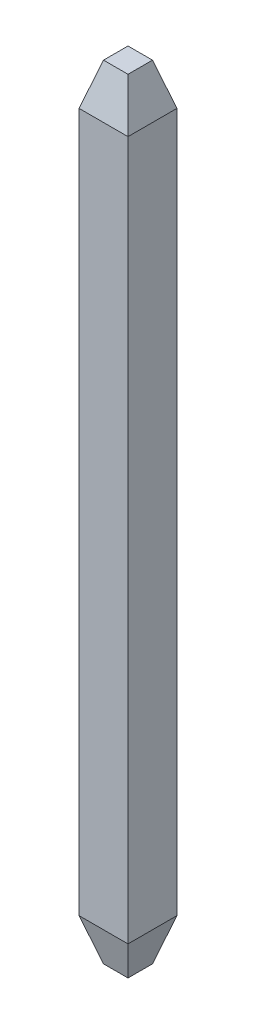
ISO-10303-21;
HEADER;
FILE_DESCRIPTION(('STEP AP214'),'2;1');
FILE_NAME('part.step','',(''),(''),'','','');
FILE_SCHEMA(('AUTOMOTIVE_DESIGN { 1 0 10303 214 1 1 1 1 }'));
ENDSEC;
DATA;
#1=APPLICATION_CONTEXT('core data for automotive mechanical design processes');
#2=APPLICATION_PROTOCOL_DEFINITION('international standard','automotive_design',2000,#1);
#3=PRODUCT_CONTEXT('',#1,'mechanical');
#4=PRODUCT('Part','Part','',(#3));
#5=PRODUCT_RELATED_PRODUCT_CATEGORY('part','',(#4));
#6=PRODUCT_DEFINITION_FORMATION('','',#4);
#7=PRODUCT_DEFINITION_CONTEXT('part definition',#1,'design');
#8=PRODUCT_DEFINITION('design','',#6,#7);
#9=PRODUCT_DEFINITION_SHAPE('','',#8);
#10=(LENGTH_UNIT() NAMED_UNIT(*) SI_UNIT(.MILLI.,.METRE.));
#11=(NAMED_UNIT(*) PLANE_ANGLE_UNIT() SI_UNIT($,.RADIAN.));
#12=(NAMED_UNIT(*) SI_UNIT($,.STERADIAN.) SOLID_ANGLE_UNIT());
#13=UNCERTAINTY_MEASURE_WITH_UNIT(LENGTH_MEASURE(1.E-05),#10,'distance_accuracy_value','');
#14=(GEOMETRIC_REPRESENTATION_CONTEXT(3) GLOBAL_UNCERTAINTY_ASSIGNED_CONTEXT((#13)) GLOBAL_UNIT_ASSIGNED_CONTEXT((#10,
#11,#12)) REPRESENTATION_CONTEXT('',''));
#15=CARTESIAN_POINT('',(0.,0.,0.));
#16=DIRECTION('',(0.,0.,1.));
#17=DIRECTION('',(1.,0.,0.));
#18=AXIS2_PLACEMENT_3D('',#15,#16,#17);
#19=CARTESIAN_POINT('',(-13.809999999987,-10.1039999999832,-17.2999999999763));
#20=DIRECTION('',(0.,-0.281214622974643,-0.959644900900968));
#21=DIRECTION('',(0.,-0.959644900900968,0.281214622974643));
#22=AXIS2_PLACEMENT_3D('',#19,#20,#21);
#23=PLANE('',#22);
#24=DIRECTION('',(1.,0.,0.));
#25=VECTOR('',#24,1.);
#26=CARTESIAN_POINT('',(-14.129999999987,-10.1039999999832,-17.2999999999763));
#27=LINE('',#26,#25);
#28=CARTESIAN_POINT('',(-14.129999999987,-10.1039999999832,-17.2999999999763));
#29=VERTEX_POINT('',#28);
#30=CARTESIAN_POINT('',(-13.489999999987,-10.1039999999832,-17.2999999999763));
#31=VERTEX_POINT('',#30);
#32=EDGE_CURVE('E11',#29,#31,#27,.T.);
#33=ORIENTED_EDGE('',*,*,#32,.T.);
#34=DIRECTION('',(-0.270714017147724,-0.923811583516618,0.270714017147727));
#35=VECTOR('',#34,1.);
#36=CARTESIAN_POINT('',(-13.489999999987,-10.1039999999832,-17.2999999999763));
#37=LINE('',#36,#35);
#38=CARTESIAN_POINT('',(-13.649999999987,-10.6499999999832,-17.1399999999763));
#39=VERTEX_POINT('',#38);
#40=EDGE_CURVE('E27',#31,#39,#37,.T.);
#41=ORIENTED_EDGE('',*,*,#40,.T.);
#42=DIRECTION('',(1.,0.,0.));
#43=VECTOR('',#42,1.);
#44=CARTESIAN_POINT('',(-13.969999999987,-10.6499999999832,-17.1399999999763));
#45=LINE('',#44,#43);
#46=CARTESIAN_POINT('',(-13.969999999987,-10.6499999999832,-17.1399999999763));
#47=VERTEX_POINT('',#46);
#48=EDGE_CURVE('E143',#47,#39,#45,.T.);
#49=ORIENTED_EDGE('',*,*,#48,.F.);
#50=DIRECTION('',(0.270714017147727,-0.923811583516618,0.270714017147727));
#51=VECTOR('',#50,1.);
#52=CARTESIAN_POINT('',(-14.129999999987,-10.1039999999832,-17.2999999999763));
#53=LINE('',#52,#51);
#54=EDGE_CURVE('E148',#29,#47,#53,.T.);
#55=ORIENTED_EDGE('',*,*,#54,.F.);
#56=EDGE_LOOP('',(#33,#41,#49,#55));
#57=FACE_BOUND('',#56,.T.);
#58=ADVANCED_FACE('F17',(#57),#23,.T.);
#59=CARTESIAN_POINT('',(-13.488999999987,-5.53443505344795,-17.2999999999763));
#60=DIRECTION('',(0.,0.,-1.));
#61=DIRECTION('',(0.,-1.,0.));
#62=AXIS2_PLACEMENT_3D('',#59,#60,#61);
#63=PLANE('',#62);
#64=DIRECTION('',(0.,1.,0.));
#65=VECTOR('',#64,1.);
#66=CARTESIAN_POINT('',(-13.489999999987,-10.1039999999832,-17.2999999999763));
#67=LINE('',#66,#65);
#68=CARTESIAN_POINT('',(-13.489999999987,-0.965870106912691,-17.2999999999763));
#69=VERTEX_POINT('',#68);
#70=EDGE_CURVE('E41',#31,#69,#67,.T.);
#71=ORIENTED_EDGE('',*,*,#70,.F.);
#72=ORIENTED_EDGE('',*,*,#32,.F.);
#73=DIRECTION('',(0.,1.,0.));
#74=VECTOR('',#73,1.);
#75=CARTESIAN_POINT('',(-14.129999999987,-10.1039999999832,-17.2999999999763));
#76=LINE('',#75,#74);
#77=CARTESIAN_POINT('',(-14.129999999987,-0.965870106912691,-17.2999999999763));
#78=VERTEX_POINT('',#77);
#79=EDGE_CURVE('E156',#29,#78,#76,.T.);
#80=ORIENTED_EDGE('',*,*,#79,.T.);
#81=DIRECTION('',(1.,0.,0.));
#82=VECTOR('',#81,1.);
#83=CARTESIAN_POINT('',(-14.129999999987,-0.965870106912693,-17.2999999999763));
#84=LINE('',#83,#82);
#85=EDGE_CURVE('E103',#78,#69,#84,.T.);
#86=ORIENTED_EDGE('',*,*,#85,.T.);
#87=EDGE_LOOP('',(#71,#72,#80,#86));
#88=FACE_BOUND('',#87,.T.);
#89=ADVANCED_FACE('F213',(#88),#63,.T.);
#90=CARTESIAN_POINT('',(-13.489999999987,-11.0738701069127,-16.9799999999763));
#91=DIRECTION('',(1.,0.,0.));
#92=DIRECTION('',(0.,1.,0.));
#93=AXIS2_PLACEMENT_3D('',#90,#91,#92);
#94=PLANE('',#93);
#95=DIRECTION('',(0.,1.,0.));
#96=VECTOR('',#95,1.);
#97=CARTESIAN_POINT('',(-13.489999999987,-10.1039999999832,-16.6599999999763));
#98=LINE('',#97,#96);
#99=CARTESIAN_POINT('',(-13.489999999987,-10.1039999999832,-16.6599999999763));
#100=VERTEX_POINT('',#99);
#101=CARTESIAN_POINT('',(-13.489999999987,-0.965870106912691,-16.6599999999763));
#102=VERTEX_POINT('',#101);
#103=EDGE_CURVE('E173',#100,#102,#98,.T.);
#104=ORIENTED_EDGE('',*,*,#103,.F.);
#105=DIRECTION('',(0.,0.,1.));
#106=VECTOR('',#105,1.);
#107=CARTESIAN_POINT('',(-13.489999999987,-10.1039999999832,-17.2999999999763));
#108=LINE('',#107,#106);
#109=EDGE_CURVE('E164',#31,#100,#108,.T.);
#110=ORIENTED_EDGE('',*,*,#109,.F.);
#111=ORIENTED_EDGE('',*,*,#70,.T.);
#112=DIRECTION('',(0.,0.,1.));
#113=VECTOR('',#112,1.);
#114=CARTESIAN_POINT('',(-13.489999999987,-0.965870106912693,-17.2999999999763));
#115=LINE('',#114,#113);
#116=EDGE_CURVE('E177',#69,#102,#115,.T.);
#117=ORIENTED_EDGE('',*,*,#116,.T.);
#118=EDGE_LOOP('',(#104,#110,#111,#117));
#119=FACE_BOUND('',#118,.T.);
#120=ADVANCED_FACE('F219',(#119),#94,.T.);
#121=CARTESIAN_POINT('',(-14.130999999987,-5.53543505344795,-16.6599999999763));
#122=DIRECTION('',(0.,0.,1.));
#123=DIRECTION('',(1.,0.,0.));
#124=AXIS2_PLACEMENT_3D('',#121,#122,#123);
#125=PLANE('',#124);
#126=DIRECTION('',(0.,1.,0.));
#127=VECTOR('',#126,1.);
#128=CARTESIAN_POINT('',(-14.129999999987,-10.1039999999832,-16.6599999999763));
#129=LINE('',#128,#127);
#130=CARTESIAN_POINT('',(-14.129999999987,-10.1039999999832,-16.6599999999763));
#131=VERTEX_POINT('',#130);
#132=CARTESIAN_POINT('',(-14.129999999987,-0.965870106912691,-16.6599999999763));
#133=VERTEX_POINT('',#132);
#134=EDGE_CURVE('E125',#131,#133,#129,.T.);
#135=ORIENTED_EDGE('',*,*,#134,.F.);
#136=DIRECTION('',(-1.,0.,0.));
#137=VECTOR('',#136,1.);
#138=CARTESIAN_POINT('',(-13.489999999987,-10.1039999999832,-16.6599999999763));
#139=LINE('',#138,#137);
#140=EDGE_CURVE('E119',#100,#131,#139,.T.);
#141=ORIENTED_EDGE('',*,*,#140,.F.);
#142=ORIENTED_EDGE('',*,*,#103,.T.);
#143=DIRECTION('',(-1.,0.,0.));
#144=VECTOR('',#143,1.);
#145=CARTESIAN_POINT('',(-13.489999999987,-0.965870106912693,-16.6599999999763));
#146=LINE('',#145,#144);
#147=EDGE_CURVE('E169',#102,#133,#146,.T.);
#148=ORIENTED_EDGE('',*,*,#147,.T.);
#149=EDGE_LOOP('',(#135,#141,#142,#148));
#150=FACE_BOUND('',#149,.T.);
#151=ADVANCED_FACE('F226',(#150),#125,.T.);
#152=CARTESIAN_POINT('',(-13.809999999987,-0.965870106912693,-16.6599999999763));
#153=DIRECTION('',(0.,0.281214622974643,0.959644900900968));
#154=DIRECTION('',(1.,0.,0.));
#155=AXIS2_PLACEMENT_3D('',#152,#153,#154);
#156=PLANE('',#155);
#157=DIRECTION('',(-0.270714017147724,0.923811583516618,-0.270714017147727));
#158=VECTOR('',#157,1.);
#159=CARTESIAN_POINT('',(-13.489999999987,-0.965870106912693,-16.6599999999763));
#160=LINE('',#159,#158);
#161=CARTESIAN_POINT('',(-13.649999999987,-0.419870106912695,-16.8199999999763));
#162=VERTEX_POINT('',#161);
#163=EDGE_CURVE('E147',#102,#162,#160,.T.);
#164=ORIENTED_EDGE('',*,*,#163,.T.);
#165=DIRECTION('',(-1.,0.,0.));
#166=VECTOR('',#165,1.);
#167=CARTESIAN_POINT('',(-13.649999999987,-0.419870106912693,-16.8199999999763));
#168=LINE('',#167,#166);
#169=CARTESIAN_POINT('',(-13.969999999987,-0.419870106912695,-16.8199999999763));
#170=VERTEX_POINT('',#169);
#171=EDGE_CURVE('E144',#162,#170,#168,.T.);
#172=ORIENTED_EDGE('',*,*,#171,.T.);
#173=DIRECTION('',(0.270714017147727,0.923811583516618,-0.270714017147727));
#174=VECTOR('',#173,1.);
#175=CARTESIAN_POINT('',(-14.129999999987,-0.965870106912693,-16.6599999999763));
#176=LINE('',#175,#174);
#177=EDGE_CURVE('E114',#133,#170,#176,.T.);
#178=ORIENTED_EDGE('',*,*,#177,.F.);
#179=ORIENTED_EDGE('',*,*,#147,.F.);
#180=EDGE_LOOP('',(#164,#172,#178,#179));
#181=FACE_BOUND('',#180,.T.);
#182=ADVANCED_FACE('F308',(#181),#156,.T.);
#183=CARTESIAN_POINT('',(-14.129999999987,-0.965870106912693,-16.9799999999763));
#184=DIRECTION('',(-0.959644900900968,0.281214622974643,0.));
#185=DIRECTION('',(0.,0.,1.));
#186=AXIS2_PLACEMENT_3D('',#183,#184,#185);
#187=PLANE('',#186);
#188=ORIENTED_EDGE('',*,*,#177,.T.);
#189=DIRECTION('',(0.,0.,-1.));
#190=VECTOR('',#189,1.);
#191=CARTESIAN_POINT('',(-13.969999999987,-0.419870106912693,-16.8199999999763));
#192=LINE('',#191,#190);
#193=CARTESIAN_POINT('',(-13.969999999987,-0.419870106912695,-17.1399999999763));
#194=VERTEX_POINT('',#193);
#195=EDGE_CURVE('E111',#170,#194,#192,.T.);
#196=ORIENTED_EDGE('',*,*,#195,.T.);
#197=DIRECTION('',(0.270714017147727,0.923811583516618,0.270714017147727));
#198=VECTOR('',#197,1.);
#199=CARTESIAN_POINT('',(-14.129999999987,-0.965870106912693,-17.2999999999763));
#200=LINE('',#199,#198);
#201=EDGE_CURVE('E97',#78,#194,#200,.T.);
#202=ORIENTED_EDGE('',*,*,#201,.F.);
#203=DIRECTION('',(0.,0.,-1.));
#204=VECTOR('',#203,1.);
#205=CARTESIAN_POINT('',(-14.129999999987,-0.965870106912693,-16.6599999999763));
#206=LINE('',#205,#204);
#207=EDGE_CURVE('E131',#133,#78,#206,.T.);
#208=ORIENTED_EDGE('',*,*,#207,.F.);
#209=EDGE_LOOP('',(#188,#196,#202,#208));
#210=FACE_BOUND('',#209,.T.);
#211=ADVANCED_FACE('F112',(#210),#187,.T.);
#212=CARTESIAN_POINT('',(-13.809999999987,-0.419870106912693,-17.1409999999763));
#213=DIRECTION('',(0.,1.,0.));
#214=DIRECTION('',(1.,0.,0.));
#215=AXIS2_PLACEMENT_3D('',#212,#213,#214);
#216=PLANE('',#215);
#217=DIRECTION('',(1.,0.,0.));
#218=VECTOR('',#217,1.);
#219=CARTESIAN_POINT('',(-13.969999999987,-0.419870106912693,-17.1399999999763));
#220=LINE('',#219,#218);
#221=CARTESIAN_POINT('',(-13.649999999987,-0.419870106912695,-17.1399999999763));
#222=VERTEX_POINT('',#221);
#223=EDGE_CURVE('E20',#194,#222,#220,.T.);
#224=ORIENTED_EDGE('',*,*,#223,.F.);
#225=ORIENTED_EDGE('',*,*,#195,.F.);
#226=ORIENTED_EDGE('',*,*,#171,.F.);
#227=DIRECTION('',(0.,0.,1.));
#228=VECTOR('',#227,1.);
#229=CARTESIAN_POINT('',(-13.649999999987,-0.419870106912693,-17.1399999999763));
#230=LINE('',#229,#228);
#231=EDGE_CURVE('E108',#222,#162,#230,.T.);
#232=ORIENTED_EDGE('',*,*,#231,.F.);
#233=EDGE_LOOP('',(#224,#225,#226,#232));
#234=FACE_BOUND('',#233,.T.);
#235=ADVANCED_FACE('F121',(#234),#216,.T.);
#236=CARTESIAN_POINT('',(-13.809999999987,-10.1039999999832,-16.6599999999763));
#237=DIRECTION('',(0.,-0.281214622974643,0.959644900900968));
#238=DIRECTION('',(-1.,0.,0.));
#239=AXIS2_PLACEMENT_3D('',#236,#237,#238);
#240=PLANE('',#239);
#241=ORIENTED_EDGE('',*,*,#140,.T.);
#242=DIRECTION('',(0.270714017147727,-0.923811583516618,-0.270714017147727));
#243=VECTOR('',#242,1.);
#244=CARTESIAN_POINT('',(-14.129999999987,-10.1039999999832,-16.6599999999763));
#245=LINE('',#244,#243);
#246=CARTESIAN_POINT('',(-13.969999999987,-10.6499999999832,-16.8199999999763));
#247=VERTEX_POINT('',#246);
#248=EDGE_CURVE('E184',#131,#247,#245,.T.);
#249=ORIENTED_EDGE('',*,*,#248,.T.);
#250=DIRECTION('',(-1.,0.,0.));
#251=VECTOR('',#250,1.);
#252=CARTESIAN_POINT('',(-13.649999999987,-10.6499999999832,-16.8199999999763));
#253=LINE('',#252,#251);
#254=CARTESIAN_POINT('',(-13.649999999987,-10.6499999999832,-16.8199999999763));
#255=VERTEX_POINT('',#254);
#256=EDGE_CURVE('E161',#255,#247,#253,.T.);
#257=ORIENTED_EDGE('',*,*,#256,.F.);
#258=DIRECTION('',(-0.270714017147724,-0.923811583516618,-0.270714017147727));
#259=VECTOR('',#258,1.);
#260=CARTESIAN_POINT('',(-13.489999999987,-10.1039999999832,-16.6599999999763));
#261=LINE('',#260,#259);
#262=EDGE_CURVE('E162',#100,#255,#261,.T.);
#263=ORIENTED_EDGE('',*,*,#262,.F.);
#264=EDGE_LOOP('',(#241,#249,#257,#263));
#265=FACE_BOUND('',#264,.T.);
#266=ADVANCED_FACE('F228',(#265),#240,.T.);
#267=CARTESIAN_POINT('',(-13.489999999987,-0.965870106912693,-16.9799999999763));
#268=DIRECTION('',(0.95964490090097,0.281214622974639,0.));
#269=DIRECTION('',(0.,0.,-1.));
#270=AXIS2_PLACEMENT_3D('',#267,#268,#269);
#271=PLANE('',#270);
#272=DIRECTION('',(-0.270714017147724,0.923811583516618,0.270714017147727));
#273=VECTOR('',#272,1.);
#274=CARTESIAN_POINT('',(-13.489999999987,-0.965870106912693,-17.2999999999763));
#275=LINE('',#274,#273);
#276=EDGE_CURVE('E192',#69,#222,#275,.T.);
#277=ORIENTED_EDGE('',*,*,#276,.T.);
#278=ORIENTED_EDGE('',*,*,#231,.T.);
#279=ORIENTED_EDGE('',*,*,#163,.F.);
#280=ORIENTED_EDGE('',*,*,#116,.F.);
#281=EDGE_LOOP('',(#277,#278,#279,#280));
#282=FACE_BOUND('',#281,.T.);
#283=ADVANCED_FACE('F305',(#282),#271,.T.);
#284=CARTESIAN_POINT('',(-13.809999999987,-0.965870106912693,-17.2999999999763));
#285=DIRECTION('',(0.,0.281214622974643,-0.959644900900968));
#286=DIRECTION('',(-1.,0.,0.));
#287=AXIS2_PLACEMENT_3D('',#284,#285,#286);
#288=PLANE('',#287);
#289=ORIENTED_EDGE('',*,*,#201,.T.);
#290=ORIENTED_EDGE('',*,*,#223,.T.);
#291=ORIENTED_EDGE('',*,*,#276,.F.);
#292=ORIENTED_EDGE('',*,*,#85,.F.);
#293=EDGE_LOOP('',(#289,#290,#291,#292));
#294=FACE_BOUND('',#293,.T.);
#295=ADVANCED_FACE('F99',(#294),#288,.T.);
#296=CARTESIAN_POINT('',(-14.129999999987,-5.53543505344795,-16.6589999999763));
#297=DIRECTION('',(-1.,0.,0.));
#298=DIRECTION('',(0.,0.,1.));
#299=AXIS2_PLACEMENT_3D('',#296,#297,#298);
#300=PLANE('',#299);
#301=ORIENTED_EDGE('',*,*,#79,.F.);
#302=DIRECTION('',(0.,0.,-1.));
#303=VECTOR('',#302,1.);
#304=CARTESIAN_POINT('',(-14.129999999987,-10.1039999999832,-16.6599999999763));
#305=LINE('',#304,#303);
#306=EDGE_CURVE('E139',#131,#29,#305,.T.);
#307=ORIENTED_EDGE('',*,*,#306,.F.);
#308=ORIENTED_EDGE('',*,*,#134,.T.);
#309=ORIENTED_EDGE('',*,*,#207,.T.);
#310=EDGE_LOOP('',(#301,#307,#308,#309));
#311=FACE_BOUND('',#310,.T.);
#312=ADVANCED_FACE('F212',(#311),#300,.T.);
#313=CARTESIAN_POINT('',(-14.129999999987,-10.1039999999832,-16.9799999999763));
#314=DIRECTION('',(-0.959644900900968,-0.281214622974643,0.));
#315=DIRECTION('',(-0.281214622974643,0.959644900900968,0.));
#316=AXIS2_PLACEMENT_3D('',#313,#314,#315);
#317=PLANE('',#316);
#318=ORIENTED_EDGE('',*,*,#306,.T.);
#319=ORIENTED_EDGE('',*,*,#54,.T.);
#320=DIRECTION('',(0.,0.,-1.));
#321=VECTOR('',#320,1.);
#322=CARTESIAN_POINT('',(-13.969999999987,-10.6499999999832,-16.8199999999763));
#323=LINE('',#322,#321);
#324=EDGE_CURVE('E157',#247,#47,#323,.T.);
#325=ORIENTED_EDGE('',*,*,#324,.F.);
#326=ORIENTED_EDGE('',*,*,#248,.F.);
#327=EDGE_LOOP('',(#318,#319,#325,#326));
#328=FACE_BOUND('',#327,.T.);
#329=ADVANCED_FACE('F209',(#328),#317,.T.);
#330=CARTESIAN_POINT('',(-13.970999999987,-10.6499999999832,-16.9799999999763));
#331=DIRECTION('',(0.,-1.,0.));
#332=DIRECTION('',(0.,0.,-1.));
#333=AXIS2_PLACEMENT_3D('',#330,#331,#332);
#334=PLANE('',#333);
#335=DIRECTION('',(0.,0.,1.));
#336=VECTOR('',#335,1.);
#337=CARTESIAN_POINT('',(-13.649999999987,-10.6499999999832,-17.1399999999763));
#338=LINE('',#337,#336);
#339=EDGE_CURVE('E152',#39,#255,#338,.T.);
#340=ORIENTED_EDGE('',*,*,#339,.T.);
#341=ORIENTED_EDGE('',*,*,#256,.T.);
#342=ORIENTED_EDGE('',*,*,#324,.T.);
#343=ORIENTED_EDGE('',*,*,#48,.T.);
#344=EDGE_LOOP('',(#340,#341,#342,#343));
#345=FACE_BOUND('',#344,.T.);
#346=ADVANCED_FACE('F230',(#345),#334,.T.);
#347=CARTESIAN_POINT('',(-13.489999999987,-10.1039999999832,-16.9799999999763));
#348=DIRECTION('',(0.959644900900969,-0.28121462297464,0.));
#349=DIRECTION('',(0.,0.,-1.));
#350=AXIS2_PLACEMENT_3D('',#347,#348,#349);
#351=PLANE('',#350);
#352=ORIENTED_EDGE('',*,*,#109,.T.);
#353=ORIENTED_EDGE('',*,*,#262,.T.);
#354=ORIENTED_EDGE('',*,*,#339,.F.);
#355=ORIENTED_EDGE('',*,*,#40,.F.);
#356=EDGE_LOOP('',(#352,#353,#354,#355));
#357=FACE_BOUND('',#356,.T.);
#358=ADVANCED_FACE('F223',(#357),#351,.T.);
#359=CLOSED_SHELL('',(#58,#89,#120,#151,#182,#211,#235,#266,#283,#295,#312,#329,#346,#358));
#360=MANIFOLD_SOLID_BREP('B1',#359);
#361=ADVANCED_BREP_SHAPE_REPRESENTATION('',(#18,#360),#14);
#362=SHAPE_DEFINITION_REPRESENTATION(#9,#361);
ENDSEC;
END-ISO-10303-21;
